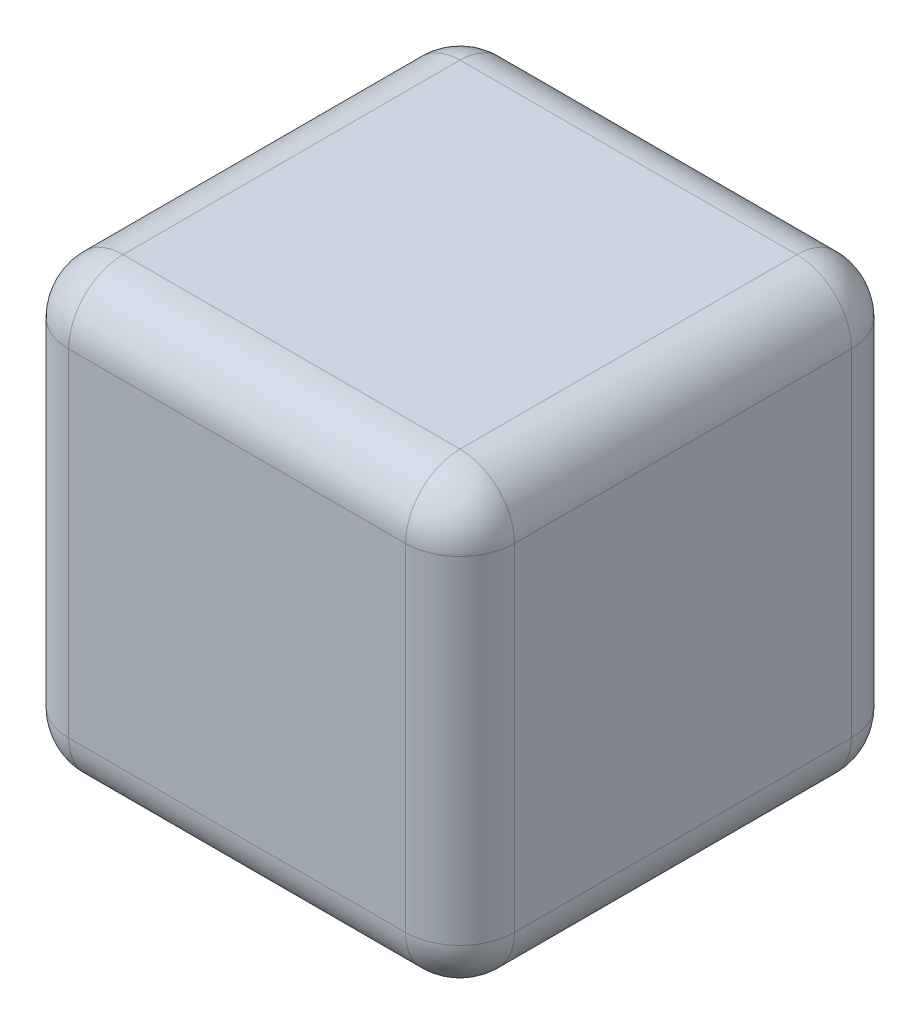
ISO-10303-21;
HEADER;
FILE_DESCRIPTION(('STEP AP214'),'2;1');
FILE_NAME('part.step','',(''),(''),'','','');
FILE_SCHEMA(('AUTOMOTIVE_DESIGN { 1 0 10303 214 1 1 1 1 }'));
ENDSEC;
DATA;
#1=APPLICATION_CONTEXT('core data for automotive mechanical design processes');
#2=APPLICATION_PROTOCOL_DEFINITION('international standard','automotive_design',2000,#1);
#3=PRODUCT_CONTEXT('',#1,'mechanical');
#4=PRODUCT('Part','Part','',(#3));
#5=PRODUCT_RELATED_PRODUCT_CATEGORY('part','',(#4));
#6=PRODUCT_DEFINITION_FORMATION('','',#4);
#7=PRODUCT_DEFINITION_CONTEXT('part definition',#1,'design');
#8=PRODUCT_DEFINITION('design','',#6,#7);
#9=PRODUCT_DEFINITION_SHAPE('','',#8);
#10=(LENGTH_UNIT() NAMED_UNIT(*) SI_UNIT(.MILLI.,.METRE.));
#11=(NAMED_UNIT(*) PLANE_ANGLE_UNIT() SI_UNIT($,.RADIAN.));
#12=(NAMED_UNIT(*) SI_UNIT($,.STERADIAN.) SOLID_ANGLE_UNIT());
#13=UNCERTAINTY_MEASURE_WITH_UNIT(LENGTH_MEASURE(1.E-05),#10,'distance_accuracy_value','');
#14=(GEOMETRIC_REPRESENTATION_CONTEXT(3) GLOBAL_UNCERTAINTY_ASSIGNED_CONTEXT((#13)) GLOBAL_UNIT_ASSIGNED_CONTEXT((#10,
#11,#12)) REPRESENTATION_CONTEXT('',''));
#15=CARTESIAN_POINT('',(0.,0.,0.));
#16=DIRECTION('',(0.,0.,1.));
#17=DIRECTION('',(1.,0.,0.));
#18=AXIS2_PLACEMENT_3D('',#15,#16,#17);
#19=CARTESIAN_POINT('',(45.,90.,-45.));
#20=DIRECTION('',(-1.,0.,0.));
#21=DIRECTION('',(0.,0.,1.));
#22=AXIS2_PLACEMENT_3D('',#19,#20,#21);
#23=PLANE('',#22);
#24=DIRECTION('',(0.,0.,-1.));
#25=VECTOR('',#24,1.);
#26=CARTESIAN_POINT('',(45.,79.,45.));
#27=LINE('',#26,#25);
#28=CARTESIAN_POINT('',(45.,79.,-34.));
#29=VERTEX_POINT('',#28);
#30=CARTESIAN_POINT('',(45.,79.,34.));
#31=VERTEX_POINT('',#30);
#32=EDGE_CURVE('E42',#29,#31,#27,.F.);
#33=ORIENTED_EDGE('',*,*,#32,.T.);
#34=DIRECTION('',(0.,-1.,0.));
#35=VECTOR('',#34,1.);
#36=CARTESIAN_POINT('',(45.,90.,34.));
#37=LINE('',#36,#35);
#38=CARTESIAN_POINT('',(45.,11.,34.));
#39=VERTEX_POINT('',#38);
#40=EDGE_CURVE('E11',#31,#39,#37,.T.);
#41=ORIENTED_EDGE('',*,*,#40,.T.);
#42=DIRECTION('',(0.,0.,-1.));
#43=VECTOR('',#42,1.);
#44=CARTESIAN_POINT('',(45.,11.,-45.));
#45=LINE('',#44,#43);
#46=CARTESIAN_POINT('',(45.,11.,-34.));
#47=VERTEX_POINT('',#46);
#48=EDGE_CURVE('E194',#39,#47,#45,.T.);
#49=ORIENTED_EDGE('',*,*,#48,.T.);
#50=DIRECTION('',(0.,-1.,0.));
#51=VECTOR('',#50,1.);
#52=CARTESIAN_POINT('',(45.,90.,-34.));
#53=LINE('',#52,#51);
#54=EDGE_CURVE('E53',#47,#29,#53,.F.);
#55=ORIENTED_EDGE('',*,*,#54,.T.);
#56=EDGE_LOOP('',(#33,#41,#49,#55));
#57=FACE_BOUND('',#56,.T.);
#58=ADVANCED_FACE('F33',(#57),#23,.F.);
#59=CARTESIAN_POINT('',(-45.,90.,-45.));
#60=DIRECTION('',(0.,0.,1.));
#61=DIRECTION('',(1.,0.,0.));
#62=AXIS2_PLACEMENT_3D('',#59,#60,#61);
#63=PLANE('',#62);
#64=DIRECTION('',(-1.,0.,0.));
#65=VECTOR('',#64,1.);
#66=CARTESIAN_POINT('',(-45.,11.,-45.));
#67=LINE('',#66,#65);
#68=CARTESIAN_POINT('',(34.,11.,-45.));
#69=VERTEX_POINT('',#68);
#70=CARTESIAN_POINT('',(-34.,11.,-45.));
#71=VERTEX_POINT('',#70);
#72=EDGE_CURVE('E178',#69,#71,#67,.T.);
#73=ORIENTED_EDGE('',*,*,#72,.T.);
#74=DIRECTION('',(0.,-1.,0.));
#75=VECTOR('',#74,1.);
#76=CARTESIAN_POINT('',(-34.,90.,-45.));
#77=LINE('',#76,#75);
#78=CARTESIAN_POINT('',(-34.,79.,-45.));
#79=VERTEX_POINT('',#78);
#80=EDGE_CURVE('E183',#71,#79,#77,.F.);
#81=ORIENTED_EDGE('',*,*,#80,.T.);
#82=DIRECTION('',(-1.,0.,0.));
#83=VECTOR('',#82,1.);
#84=CARTESIAN_POINT('',(45.,79.,-45.));
#85=LINE('',#84,#83);
#86=CARTESIAN_POINT('',(34.,79.,-45.));
#87=VERTEX_POINT('',#86);
#88=EDGE_CURVE('E180',#79,#87,#85,.F.);
#89=ORIENTED_EDGE('',*,*,#88,.T.);
#90=DIRECTION('',(0.,-1.,0.));
#91=VECTOR('',#90,1.);
#92=CARTESIAN_POINT('',(34.,90.,-45.));
#93=LINE('',#92,#91);
#94=EDGE_CURVE('E176',#87,#69,#93,.T.);
#95=ORIENTED_EDGE('',*,*,#94,.T.);
#96=EDGE_LOOP('',(#73,#81,#89,#95));
#97=FACE_BOUND('',#96,.T.);
#98=ADVANCED_FACE('F313',(#97),#63,.F.);
#99=CARTESIAN_POINT('',(-45.,90.,-45.));
#100=DIRECTION('',(1.,0.,0.));
#101=DIRECTION('',(0.,0.,-1.));
#102=AXIS2_PLACEMENT_3D('',#99,#100,#101);
#103=PLANE('',#102);
#104=DIRECTION('',(0.,0.,1.));
#105=VECTOR('',#104,1.);
#106=CARTESIAN_POINT('',(-45.,79.,-45.));
#107=LINE('',#106,#105);
#108=CARTESIAN_POINT('',(-45.,79.,34.));
#109=VERTEX_POINT('',#108);
#110=CARTESIAN_POINT('',(-45.,79.,-34.));
#111=VERTEX_POINT('',#110);
#112=EDGE_CURVE('E189',#109,#111,#107,.F.);
#113=ORIENTED_EDGE('',*,*,#112,.T.);
#114=DIRECTION('',(0.,-1.,0.));
#115=VECTOR('',#114,1.);
#116=CARTESIAN_POINT('',(-45.,90.,-34.));
#117=LINE('',#116,#115);
#118=CARTESIAN_POINT('',(-45.,11.,-34.));
#119=VERTEX_POINT('',#118);
#120=EDGE_CURVE('E191',#111,#119,#117,.T.);
#121=ORIENTED_EDGE('',*,*,#120,.T.);
#122=DIRECTION('',(0.,0.,1.));
#123=VECTOR('',#122,1.);
#124=CARTESIAN_POINT('',(-45.,11.,-45.));
#125=LINE('',#124,#123);
#126=CARTESIAN_POINT('',(-45.,11.,34.));
#127=VERTEX_POINT('',#126);
#128=EDGE_CURVE('E185',#119,#127,#125,.T.);
#129=ORIENTED_EDGE('',*,*,#128,.T.);
#130=DIRECTION('',(0.,-1.,0.));
#131=VECTOR('',#130,1.);
#132=CARTESIAN_POINT('',(-45.,90.,34.));
#133=LINE('',#132,#131);
#134=EDGE_CURVE('E187',#127,#109,#133,.F.);
#135=ORIENTED_EDGE('',*,*,#134,.T.);
#136=EDGE_LOOP('',(#113,#121,#129,#135));
#137=FACE_BOUND('',#136,.T.);
#138=ADVANCED_FACE('F269',(#137),#103,.F.);
#139=CARTESIAN_POINT('',(-45.,90.,45.));
#140=DIRECTION('',(0.,0.,-1.));
#141=DIRECTION('',(-1.,0.,0.));
#142=AXIS2_PLACEMENT_3D('',#139,#140,#141);
#143=PLANE('',#142);
#144=DIRECTION('',(1.,0.,0.));
#145=VECTOR('',#144,1.);
#146=CARTESIAN_POINT('',(-45.,79.,45.));
#147=LINE('',#146,#145);
#148=CARTESIAN_POINT('',(34.,79.,45.));
#149=VERTEX_POINT('',#148);
#150=CARTESIAN_POINT('',(-34.,79.,45.));
#151=VERTEX_POINT('',#150);
#152=EDGE_CURVE('E129',#149,#151,#147,.F.);
#153=ORIENTED_EDGE('',*,*,#152,.T.);
#154=DIRECTION('',(0.,-1.,0.));
#155=VECTOR('',#154,1.);
#156=CARTESIAN_POINT('',(-34.,90.,45.));
#157=LINE('',#156,#155);
#158=CARTESIAN_POINT('',(-34.,11.,45.));
#159=VERTEX_POINT('',#158);
#160=EDGE_CURVE('E165',#151,#159,#157,.T.);
#161=ORIENTED_EDGE('',*,*,#160,.T.);
#162=DIRECTION('',(1.,0.,0.));
#163=VECTOR('',#162,1.);
#164=CARTESIAN_POINT('',(-45.,11.,45.));
#165=LINE('',#164,#163);
#166=CARTESIAN_POINT('',(34.,11.,45.));
#167=VERTEX_POINT('',#166);
#168=EDGE_CURVE('E162',#159,#167,#165,.T.);
#169=ORIENTED_EDGE('',*,*,#168,.T.);
#170=DIRECTION('',(0.,-1.,0.));
#171=VECTOR('',#170,1.);
#172=CARTESIAN_POINT('',(34.,90.,45.));
#173=LINE('',#172,#171);
#174=EDGE_CURVE('E157',#167,#149,#173,.F.);
#175=ORIENTED_EDGE('',*,*,#174,.T.);
#176=EDGE_LOOP('',(#153,#161,#169,#175));
#177=FACE_BOUND('',#176,.T.);
#178=ADVANCED_FACE('F291',(#177),#143,.F.);
#179=CARTESIAN_POINT('',(0.,90.,0.));
#180=DIRECTION('',(0.,1.,0.));
#181=DIRECTION('',(0.,0.,1.));
#182=AXIS2_PLACEMENT_3D('',#179,#180,#181);
#183=PLANE('',#182);
#184=DIRECTION('',(-1.,0.,0.));
#185=VECTOR('',#184,1.);
#186=CARTESIAN_POINT('',(-45.,90.,-34.));
#187=LINE('',#186,#185);
#188=CARTESIAN_POINT('',(34.,90.,-34.));
#189=VERTEX_POINT('',#188);
#190=CARTESIAN_POINT('',(-34.,90.,-34.));
#191=VERTEX_POINT('',#190);
#192=EDGE_CURVE('E150',#189,#191,#187,.T.);
#193=ORIENTED_EDGE('',*,*,#192,.T.);
#194=DIRECTION('',(0.,0.,1.));
#195=VECTOR('',#194,1.);
#196=CARTESIAN_POINT('',(-34.,90.,45.));
#197=LINE('',#196,#195);
#198=CARTESIAN_POINT('',(-34.,90.,34.));
#199=VERTEX_POINT('',#198);
#200=EDGE_CURVE('E154',#191,#199,#197,.T.);
#201=ORIENTED_EDGE('',*,*,#200,.T.);
#202=DIRECTION('',(1.,0.,0.));
#203=VECTOR('',#202,1.);
#204=CARTESIAN_POINT('',(45.,90.,34.));
#205=LINE('',#204,#203);
#206=CARTESIAN_POINT('',(34.,90.,34.));
#207=VERTEX_POINT('',#206);
#208=EDGE_CURVE('E127',#199,#207,#205,.T.);
#209=ORIENTED_EDGE('',*,*,#208,.T.);
#210=DIRECTION('',(0.,0.,-1.));
#211=VECTOR('',#210,1.);
#212=CARTESIAN_POINT('',(34.,90.,-45.));
#213=LINE('',#212,#211);
#214=EDGE_CURVE('E144',#207,#189,#213,.T.);
#215=ORIENTED_EDGE('',*,*,#214,.T.);
#216=EDGE_LOOP('',(#193,#201,#209,#215));
#217=FACE_BOUND('',#216,.T.);
#218=ADVANCED_FACE('F152',(#217),#183,.T.);
#219=CARTESIAN_POINT('',(0.,0.,0.));
#220=DIRECTION('',(0.,1.,0.));
#221=DIRECTION('',(0.,0.,1.));
#222=AXIS2_PLACEMENT_3D('',#219,#220,#221);
#223=PLANE('',#222);
#224=DIRECTION('',(1.,0.,0.));
#225=VECTOR('',#224,1.);
#226=CARTESIAN_POINT('',(0.,0.,34.));
#227=LINE('',#226,#225);
#228=CARTESIAN_POINT('',(34.,0.,34.));
#229=VERTEX_POINT('',#228);
#230=CARTESIAN_POINT('',(-34.,0.,34.));
#231=VERTEX_POINT('',#230);
#232=EDGE_CURVE('E171',#229,#231,#227,.F.);
#233=ORIENTED_EDGE('',*,*,#232,.T.);
#234=DIRECTION('',(0.,0.,1.));
#235=VECTOR('',#234,1.);
#236=CARTESIAN_POINT('',(-34.,0.,0.));
#237=LINE('',#236,#235);
#238=CARTESIAN_POINT('',(-34.,0.,-34.));
#239=VERTEX_POINT('',#238);
#240=EDGE_CURVE('E174',#231,#239,#237,.F.);
#241=ORIENTED_EDGE('',*,*,#240,.T.);
#242=DIRECTION('',(-1.,0.,0.));
#243=VECTOR('',#242,1.);
#244=CARTESIAN_POINT('',(0.,0.,-34.));
#245=LINE('',#244,#243);
#246=CARTESIAN_POINT('',(34.,0.,-34.));
#247=VERTEX_POINT('',#246);
#248=EDGE_CURVE('E169',#239,#247,#245,.F.);
#249=ORIENTED_EDGE('',*,*,#248,.T.);
#250=DIRECTION('',(0.,0.,-1.));
#251=VECTOR('',#250,1.);
#252=CARTESIAN_POINT('',(34.,0.,0.));
#253=LINE('',#252,#251);
#254=EDGE_CURVE('E167',#247,#229,#253,.F.);
#255=ORIENTED_EDGE('',*,*,#254,.T.);
#256=EDGE_LOOP('',(#233,#241,#249,#255));
#257=FACE_BOUND('',#256,.T.);
#258=ADVANCED_FACE('F315',(#257),#223,.F.);
#259=CARTESIAN_POINT('',(-45.,11.,-34.));
#260=DIRECTION('',(-1.,0.,0.));
#261=DIRECTION('',(0.,0.,1.));
#262=AXIS2_PLACEMENT_3D('',#259,#260,#261);
#263=CYLINDRICAL_SURFACE('',#262,11.);
#264=CARTESIAN_POINT('',(-34.,11.,-34.));
#265=DIRECTION('',(-1.,0.,0.));
#266=DIRECTION('',(0.,0.,1.));
#267=AXIS2_PLACEMENT_3D('',#264,#265,#266);
#268=CIRCLE('',#267,11.);
#269=EDGE_CURVE('E37',#71,#239,#268,.T.);
#270=ORIENTED_EDGE('',*,*,#269,.F.);
#271=ORIENTED_EDGE('',*,*,#72,.F.);
#272=CARTESIAN_POINT('',(34.,11.,-34.));
#273=DIRECTION('',(1.,0.,0.));
#274=DIRECTION('',(0.,0.,-1.));
#275=AXIS2_PLACEMENT_3D('',#272,#273,#274);
#276=CIRCLE('',#275,11.);
#277=EDGE_CURVE('E247',#247,#69,#276,.T.);
#278=ORIENTED_EDGE('',*,*,#277,.F.);
#279=ORIENTED_EDGE('',*,*,#248,.F.);
#280=EDGE_LOOP('',(#270,#271,#278,#279));
#281=FACE_BOUND('',#280,.T.);
#282=ADVANCED_FACE('F35',(#281),#263,.T.);
#283=CARTESIAN_POINT('',(-34.,11.,-34.));
#284=DIRECTION('',(0.,0.,1.));
#285=DIRECTION('',(1.,0.,0.));
#286=AXIS2_PLACEMENT_3D('',#283,#284,#285);
#287=SPHERICAL_SURFACE('',#286,11.);
#288=CARTESIAN_POINT('',(-34.,11.,-34.));
#289=DIRECTION('',(0.,-1.,0.));
#290=DIRECTION('',(0.,0.,-1.));
#291=AXIS2_PLACEMENT_3D('',#288,#289,#290);
#292=CIRCLE('',#291,11.);
#293=EDGE_CURVE('E242',#71,#119,#292,.F.);
#294=ORIENTED_EDGE('',*,*,#293,.F.);
#295=ORIENTED_EDGE('',*,*,#269,.T.);
#296=CARTESIAN_POINT('',(-34.,11.,-34.));
#297=DIRECTION('',(0.,0.,-1.));
#298=DIRECTION('',(-1.,0.,0.));
#299=AXIS2_PLACEMENT_3D('',#296,#297,#298);
#300=CIRCLE('',#299,11.);
#301=EDGE_CURVE('E245',#119,#239,#300,.F.);
#302=ORIENTED_EDGE('',*,*,#301,.F.);
#303=EDGE_LOOP('',(#294,#295,#302));
#304=FACE_BOUND('',#303,.T.);
#305=ADVANCED_FACE('F258',(#304),#287,.T.);
#306=CARTESIAN_POINT('',(34.,11.,-34.));
#307=DIRECTION('',(0.,0.,1.));
#308=DIRECTION('',(1.,0.,0.));
#309=AXIS2_PLACEMENT_3D('',#306,#307,#308);
#310=SPHERICAL_SURFACE('',#309,11.);
#311=CARTESIAN_POINT('',(34.,11.,-34.));
#312=DIRECTION('',(0.,0.,-1.));
#313=DIRECTION('',(-1.,0.,0.));
#314=AXIS2_PLACEMENT_3D('',#311,#312,#313);
#315=CIRCLE('',#314,11.);
#316=EDGE_CURVE('E236',#247,#47,#315,.F.);
#317=ORIENTED_EDGE('',*,*,#316,.F.);
#318=ORIENTED_EDGE('',*,*,#277,.T.);
#319=CARTESIAN_POINT('',(34.,11.,-34.));
#320=DIRECTION('',(0.,-1.,0.));
#321=DIRECTION('',(0.,0.,-1.));
#322=AXIS2_PLACEMENT_3D('',#319,#320,#321);
#323=CIRCLE('',#322,11.);
#324=EDGE_CURVE('E239',#47,#69,#323,.F.);
#325=ORIENTED_EDGE('',*,*,#324,.F.);
#326=EDGE_LOOP('',(#317,#318,#325));
#327=FACE_BOUND('',#326,.T.);
#328=ADVANCED_FACE('F302',(#327),#310,.T.);
#329=CARTESIAN_POINT('',(-34.,11.,-45.));
#330=DIRECTION('',(0.,0.,1.));
#331=DIRECTION('',(1.,0.,0.));
#332=AXIS2_PLACEMENT_3D('',#329,#330,#331);
#333=CYLINDRICAL_SURFACE('',#332,11.);
#334=ORIENTED_EDGE('',*,*,#301,.T.);
#335=ORIENTED_EDGE('',*,*,#240,.F.);
#336=CARTESIAN_POINT('',(-34.,11.,34.));
#337=DIRECTION('',(0.,0.,1.));
#338=DIRECTION('',(1.,0.,0.));
#339=AXIS2_PLACEMENT_3D('',#336,#337,#338);
#340=CIRCLE('',#339,11.);
#341=EDGE_CURVE('E231',#127,#231,#340,.T.);
#342=ORIENTED_EDGE('',*,*,#341,.F.);
#343=ORIENTED_EDGE('',*,*,#128,.F.);
#344=EDGE_LOOP('',(#334,#335,#342,#343));
#345=FACE_BOUND('',#344,.T.);
#346=ADVANCED_FACE('F265',(#345),#333,.T.);
#347=CARTESIAN_POINT('',(-34.,90.,-34.));
#348=DIRECTION('',(0.,-1.,0.));
#349=DIRECTION('',(0.,0.,-1.));
#350=AXIS2_PLACEMENT_3D('',#347,#348,#349);
#351=CYLINDRICAL_SURFACE('',#350,11.);
#352=ORIENTED_EDGE('',*,*,#293,.T.);
#353=ORIENTED_EDGE('',*,*,#120,.F.);
#354=CARTESIAN_POINT('',(-34.,79.,-34.));
#355=DIRECTION('',(0.,1.,0.));
#356=DIRECTION('',(0.,0.,1.));
#357=AXIS2_PLACEMENT_3D('',#354,#355,#356);
#358=CIRCLE('',#357,11.);
#359=EDGE_CURVE('E228',#79,#111,#358,.T.);
#360=ORIENTED_EDGE('',*,*,#359,.F.);
#361=ORIENTED_EDGE('',*,*,#80,.F.);
#362=EDGE_LOOP('',(#352,#353,#360,#361));
#363=FACE_BOUND('',#362,.T.);
#364=ADVANCED_FACE('F275',(#363),#351,.T.);
#365=CARTESIAN_POINT('',(0.,79.,-34.));
#366=DIRECTION('',(1.,0.,0.));
#367=DIRECTION('',(0.,0.,-1.));
#368=AXIS2_PLACEMENT_3D('',#365,#366,#367);
#369=CYLINDRICAL_SURFACE('',#368,11.);
#370=CARTESIAN_POINT('',(34.,79.,-34.));
#371=DIRECTION('',(1.,0.,0.));
#372=DIRECTION('',(0.,1.,0.));
#373=AXIS2_PLACEMENT_3D('',#370,#371,#372);
#374=CIRCLE('',#373,11.);
#375=EDGE_CURVE('E222',#87,#189,#374,.T.);
#376=ORIENTED_EDGE('',*,*,#375,.F.);
#377=ORIENTED_EDGE('',*,*,#88,.F.);
#378=CARTESIAN_POINT('',(-34.,79.,-34.));
#379=DIRECTION('',(-1.,0.,0.));
#380=DIRECTION('',(0.,0.,1.));
#381=AXIS2_PLACEMENT_3D('',#378,#379,#380);
#382=CIRCLE('',#381,11.);
#383=EDGE_CURVE('E225',#191,#79,#382,.T.);
#384=ORIENTED_EDGE('',*,*,#383,.F.);
#385=ORIENTED_EDGE('',*,*,#192,.F.);
#386=EDGE_LOOP('',(#376,#377,#384,#385));
#387=FACE_BOUND('',#386,.T.);
#388=ADVANCED_FACE('F311',(#387),#369,.T.);
#389=CARTESIAN_POINT('',(34.,90.,-34.));
#390=DIRECTION('',(0.,-1.,0.));
#391=DIRECTION('',(0.,0.,-1.));
#392=AXIS2_PLACEMENT_3D('',#389,#390,#391);
#393=CYLINDRICAL_SURFACE('',#392,11.);
#394=ORIENTED_EDGE('',*,*,#324,.T.);
#395=ORIENTED_EDGE('',*,*,#94,.F.);
#396=CARTESIAN_POINT('',(34.,79.,-34.));
#397=DIRECTION('',(0.,1.,0.));
#398=DIRECTION('',(0.,0.,1.));
#399=AXIS2_PLACEMENT_3D('',#396,#397,#398);
#400=CIRCLE('',#399,11.);
#401=EDGE_CURVE('E220',#29,#87,#400,.T.);
#402=ORIENTED_EDGE('',*,*,#401,.F.);
#403=ORIENTED_EDGE('',*,*,#54,.F.);
#404=EDGE_LOOP('',(#394,#395,#402,#403));
#405=FACE_BOUND('',#404,.T.);
#406=ADVANCED_FACE('F305',(#405),#393,.T.);
#407=CARTESIAN_POINT('',(34.,11.,-45.));
#408=DIRECTION('',(0.,0.,-1.));
#409=DIRECTION('',(-1.,0.,0.));
#410=AXIS2_PLACEMENT_3D('',#407,#408,#409);
#411=CYLINDRICAL_SURFACE('',#410,11.);
#412=ORIENTED_EDGE('',*,*,#316,.T.);
#413=ORIENTED_EDGE('',*,*,#48,.F.);
#414=CARTESIAN_POINT('',(34.,11.,34.));
#415=DIRECTION('',(0.,0.,1.));
#416=DIRECTION('',(1.,0.,0.));
#417=AXIS2_PLACEMENT_3D('',#414,#415,#416);
#418=CIRCLE('',#417,11.);
#419=EDGE_CURVE('E217',#229,#39,#418,.T.);
#420=ORIENTED_EDGE('',*,*,#419,.F.);
#421=ORIENTED_EDGE('',*,*,#254,.F.);
#422=EDGE_LOOP('',(#412,#413,#420,#421));
#423=FACE_BOUND('',#422,.T.);
#424=ADVANCED_FACE('F301',(#423),#411,.T.);
#425=CARTESIAN_POINT('',(-45.,11.,34.));
#426=DIRECTION('',(1.,0.,0.));
#427=DIRECTION('',(0.,0.,-1.));
#428=AXIS2_PLACEMENT_3D('',#425,#426,#427);
#429=CYLINDRICAL_SURFACE('',#428,11.);
#430=CARTESIAN_POINT('',(-34.,11.,34.));
#431=DIRECTION('',(-1.,0.,0.));
#432=DIRECTION('',(0.,0.,1.));
#433=AXIS2_PLACEMENT_3D('',#430,#431,#432);
#434=CIRCLE('',#433,11.);
#435=EDGE_CURVE('E233',#231,#159,#434,.T.);
#436=ORIENTED_EDGE('',*,*,#435,.F.);
#437=ORIENTED_EDGE('',*,*,#232,.F.);
#438=CARTESIAN_POINT('',(34.,11.,34.));
#439=DIRECTION('',(1.,0.,0.));
#440=DIRECTION('',(0.,0.,-1.));
#441=AXIS2_PLACEMENT_3D('',#438,#439,#440);
#442=CIRCLE('',#441,11.);
#443=EDGE_CURVE('E214',#167,#229,#442,.T.);
#444=ORIENTED_EDGE('',*,*,#443,.F.);
#445=ORIENTED_EDGE('',*,*,#168,.F.);
#446=EDGE_LOOP('',(#436,#437,#444,#445));
#447=FACE_BOUND('',#446,.T.);
#448=ADVANCED_FACE('F319',(#447),#429,.T.);
#449=CARTESIAN_POINT('',(-34.,11.,34.));
#450=DIRECTION('',(0.,0.,1.));
#451=DIRECTION('',(1.,0.,0.));
#452=AXIS2_PLACEMENT_3D('',#449,#450,#451);
#453=SPHERICAL_SURFACE('',#452,11.);
#454=ORIENTED_EDGE('',*,*,#341,.T.);
#455=ORIENTED_EDGE('',*,*,#435,.T.);
#456=CARTESIAN_POINT('',(-34.,11.,34.));
#457=DIRECTION('',(0.,-1.,0.));
#458=DIRECTION('',(0.,0.,-1.));
#459=AXIS2_PLACEMENT_3D('',#456,#457,#458);
#460=CIRCLE('',#459,11.);
#461=EDGE_CURVE('E211',#127,#159,#460,.F.);
#462=ORIENTED_EDGE('',*,*,#461,.F.);
#463=EDGE_LOOP('',(#454,#455,#462));
#464=FACE_BOUND('',#463,.T.);
#465=ADVANCED_FACE('F406',(#464),#453,.T.);
#466=CARTESIAN_POINT('',(-34.,79.,-34.));
#467=DIRECTION('',(0.,0.,1.));
#468=DIRECTION('',(1.,0.,0.));
#469=AXIS2_PLACEMENT_3D('',#466,#467,#468);
#470=SPHERICAL_SURFACE('',#469,11.);
#471=ORIENTED_EDGE('',*,*,#383,.T.);
#472=ORIENTED_EDGE('',*,*,#359,.T.);
#473=CARTESIAN_POINT('',(-34.,79.,-34.));
#474=DIRECTION('',(0.,0.,-1.));
#475=DIRECTION('',(-1.,0.,0.));
#476=AXIS2_PLACEMENT_3D('',#473,#474,#475);
#477=CIRCLE('',#476,11.);
#478=EDGE_CURVE('E208',#191,#111,#477,.F.);
#479=ORIENTED_EDGE('',*,*,#478,.F.);
#480=EDGE_LOOP('',(#471,#472,#479));
#481=FACE_BOUND('',#480,.T.);
#482=ADVANCED_FACE('F278',(#481),#470,.T.);
#483=CARTESIAN_POINT('',(34.,79.,-34.));
#484=DIRECTION('',(0.,0.,1.));
#485=DIRECTION('',(1.,0.,0.));
#486=AXIS2_PLACEMENT_3D('',#483,#484,#485);
#487=SPHERICAL_SURFACE('',#486,11.);
#488=ORIENTED_EDGE('',*,*,#401,.T.);
#489=ORIENTED_EDGE('',*,*,#375,.T.);
#490=CARTESIAN_POINT('',(34.,79.,-34.));
#491=DIRECTION('',(0.,0.,-1.));
#492=DIRECTION('',(-1.,0.,0.));
#493=AXIS2_PLACEMENT_3D('',#490,#491,#492);
#494=CIRCLE('',#493,11.);
#495=EDGE_CURVE('E147',#29,#189,#494,.F.);
#496=ORIENTED_EDGE('',*,*,#495,.F.);
#497=EDGE_LOOP('',(#488,#489,#496));
#498=FACE_BOUND('',#497,.T.);
#499=ADVANCED_FACE('F308',(#498),#487,.T.);
#500=CARTESIAN_POINT('',(34.,11.,34.));
#501=DIRECTION('',(0.,0.,1.));
#502=DIRECTION('',(1.,0.,0.));
#503=AXIS2_PLACEMENT_3D('',#500,#501,#502);
#504=SPHERICAL_SURFACE('',#503,11.);
#505=ORIENTED_EDGE('',*,*,#443,.T.);
#506=ORIENTED_EDGE('',*,*,#419,.T.);
#507=CARTESIAN_POINT('',(34.,11.,34.));
#508=DIRECTION('',(0.,-1.,0.));
#509=DIRECTION('',(0.,0.,-1.));
#510=AXIS2_PLACEMENT_3D('',#507,#508,#509);
#511=CIRCLE('',#510,11.);
#512=EDGE_CURVE('E205',#167,#39,#511,.F.);
#513=ORIENTED_EDGE('',*,*,#512,.F.);
#514=EDGE_LOOP('',(#505,#506,#513));
#515=FACE_BOUND('',#514,.T.);
#516=ADVANCED_FACE('F321',(#515),#504,.T.);
#517=CARTESIAN_POINT('',(-34.,90.,34.));
#518=DIRECTION('',(0.,-1.,0.));
#519=DIRECTION('',(0.,0.,-1.));
#520=AXIS2_PLACEMENT_3D('',#517,#518,#519);
#521=CYLINDRICAL_SURFACE('',#520,11.);
#522=ORIENTED_EDGE('',*,*,#461,.T.);
#523=ORIENTED_EDGE('',*,*,#160,.F.);
#524=CARTESIAN_POINT('',(-34.,79.,34.));
#525=DIRECTION('',(0.,1.,0.));
#526=DIRECTION('',(0.,0.,1.));
#527=AXIS2_PLACEMENT_3D('',#524,#525,#526);
#528=CIRCLE('',#527,11.);
#529=EDGE_CURVE('E202',#109,#151,#528,.T.);
#530=ORIENTED_EDGE('',*,*,#529,.F.);
#531=ORIENTED_EDGE('',*,*,#134,.F.);
#532=EDGE_LOOP('',(#522,#523,#530,#531));
#533=FACE_BOUND('',#532,.T.);
#534=ADVANCED_FACE('F288',(#533),#521,.T.);
#535=CARTESIAN_POINT('',(-34.,79.,0.));
#536=DIRECTION('',(0.,0.,-1.));
#537=DIRECTION('',(-1.,0.,0.));
#538=AXIS2_PLACEMENT_3D('',#535,#536,#537);
#539=CYLINDRICAL_SURFACE('',#538,11.);
#540=ORIENTED_EDGE('',*,*,#478,.T.);
#541=ORIENTED_EDGE('',*,*,#112,.F.);
#542=CARTESIAN_POINT('',(-34.,79.,34.));
#543=DIRECTION('',(0.,0.,1.));
#544=DIRECTION('',(1.,0.,0.));
#545=AXIS2_PLACEMENT_3D('',#542,#543,#544);
#546=CIRCLE('',#545,11.);
#547=EDGE_CURVE('E141',#199,#109,#546,.T.);
#548=ORIENTED_EDGE('',*,*,#547,.F.);
#549=ORIENTED_EDGE('',*,*,#200,.F.);
#550=EDGE_LOOP('',(#540,#541,#548,#549));
#551=FACE_BOUND('',#550,.T.);
#552=ADVANCED_FACE('F281',(#551),#539,.T.);
#553=CARTESIAN_POINT('',(34.,79.,0.));
#554=DIRECTION('',(0.,0.,1.));
#555=DIRECTION('',(1.,0.,0.));
#556=AXIS2_PLACEMENT_3D('',#553,#554,#555);
#557=CYLINDRICAL_SURFACE('',#556,11.);
#558=ORIENTED_EDGE('',*,*,#495,.T.);
#559=ORIENTED_EDGE('',*,*,#214,.F.);
#560=CARTESIAN_POINT('',(34.,79.,34.));
#561=DIRECTION('',(0.,0.,1.));
#562=DIRECTION('',(0.,-1.,0.));
#563=AXIS2_PLACEMENT_3D('',#560,#561,#562);
#564=CIRCLE('',#563,11.);
#565=EDGE_CURVE('E135',#31,#207,#564,.T.);
#566=ORIENTED_EDGE('',*,*,#565,.F.);
#567=ORIENTED_EDGE('',*,*,#32,.F.);
#568=EDGE_LOOP('',(#558,#559,#566,#567));
#569=FACE_BOUND('',#568,.T.);
#570=ADVANCED_FACE('F145',(#569),#557,.T.);
#571=CARTESIAN_POINT('',(34.,90.,34.));
#572=DIRECTION('',(0.,-1.,0.));
#573=DIRECTION('',(0.,0.,-1.));
#574=AXIS2_PLACEMENT_3D('',#571,#572,#573);
#575=CYLINDRICAL_SURFACE('',#574,11.);
#576=ORIENTED_EDGE('',*,*,#512,.T.);
#577=ORIENTED_EDGE('',*,*,#40,.F.);
#578=CARTESIAN_POINT('',(34.,79.,34.));
#579=DIRECTION('',(0.,1.,0.));
#580=DIRECTION('',(0.,0.,1.));
#581=AXIS2_PLACEMENT_3D('',#578,#579,#580);
#582=CIRCLE('',#581,11.);
#583=EDGE_CURVE('E139',#149,#31,#582,.T.);
#584=ORIENTED_EDGE('',*,*,#583,.F.);
#585=ORIENTED_EDGE('',*,*,#174,.F.);
#586=EDGE_LOOP('',(#576,#577,#584,#585));
#587=FACE_BOUND('',#586,.T.);
#588=ADVANCED_FACE('F295',(#587),#575,.T.);
#589=CARTESIAN_POINT('',(-34.,79.,34.));
#590=DIRECTION('',(0.,0.,1.));
#591=DIRECTION('',(1.,0.,0.));
#592=AXIS2_PLACEMENT_3D('',#589,#590,#591);
#593=SPHERICAL_SURFACE('',#592,11.);
#594=ORIENTED_EDGE('',*,*,#547,.T.);
#595=ORIENTED_EDGE('',*,*,#529,.T.);
#596=CARTESIAN_POINT('',(-34.,79.,34.));
#597=DIRECTION('',(-1.,0.,0.));
#598=DIRECTION('',(0.,-1.,0.));
#599=AXIS2_PLACEMENT_3D('',#596,#597,#598);
#600=CIRCLE('',#599,11.);
#601=EDGE_CURVE('E132',#199,#151,#600,.F.);
#602=ORIENTED_EDGE('',*,*,#601,.F.);
#603=EDGE_LOOP('',(#594,#595,#602));
#604=FACE_BOUND('',#603,.T.);
#605=ADVANCED_FACE('F285',(#604),#593,.T.);
#606=CARTESIAN_POINT('',(34.,79.,34.));
#607=DIRECTION('',(0.,0.,1.));
#608=DIRECTION('',(1.,0.,0.));
#609=AXIS2_PLACEMENT_3D('',#606,#607,#608);
#610=SPHERICAL_SURFACE('',#609,11.);
#611=ORIENTED_EDGE('',*,*,#583,.T.);
#612=ORIENTED_EDGE('',*,*,#565,.T.);
#613=CARTESIAN_POINT('',(34.,79.,34.));
#614=DIRECTION('',(1.,0.,0.));
#615=DIRECTION('',(0.,0.,-1.));
#616=AXIS2_PLACEMENT_3D('',#613,#614,#615);
#617=CIRCLE('',#616,11.);
#618=EDGE_CURVE('E123',#149,#207,#617,.F.);
#619=ORIENTED_EDGE('',*,*,#618,.F.);
#620=EDGE_LOOP('',(#611,#612,#619));
#621=FACE_BOUND('',#620,.T.);
#622=ADVANCED_FACE('F137',(#621),#610,.T.);
#623=CARTESIAN_POINT('',(0.,79.,34.));
#624=DIRECTION('',(-1.,0.,0.));
#625=DIRECTION('',(0.,0.,1.));
#626=AXIS2_PLACEMENT_3D('',#623,#624,#625);
#627=CYLINDRICAL_SURFACE('',#626,11.);
#628=ORIENTED_EDGE('',*,*,#601,.T.);
#629=ORIENTED_EDGE('',*,*,#152,.F.);
#630=ORIENTED_EDGE('',*,*,#618,.T.);
#631=ORIENTED_EDGE('',*,*,#208,.F.);
#632=EDGE_LOOP('',(#628,#629,#630,#631));
#633=FACE_BOUND('',#632,.T.);
#634=ADVANCED_FACE('F125',(#633),#627,.T.);
#635=CLOSED_SHELL('',(#58,#98,#138,#178,#218,#258,#282,#305,#328,#346,#364,#388,#406,#424,#448,
#465,#482,#499,#516,#534,#552,#570,#588,#605,#622,#634));
#636=MANIFOLD_SOLID_BREP('B2',#635);
#637=ADVANCED_BREP_SHAPE_REPRESENTATION('',(#18,#636),#14);
#638=SHAPE_DEFINITION_REPRESENTATION(#9,#637);
ENDSEC;
END-ISO-10303-21;
